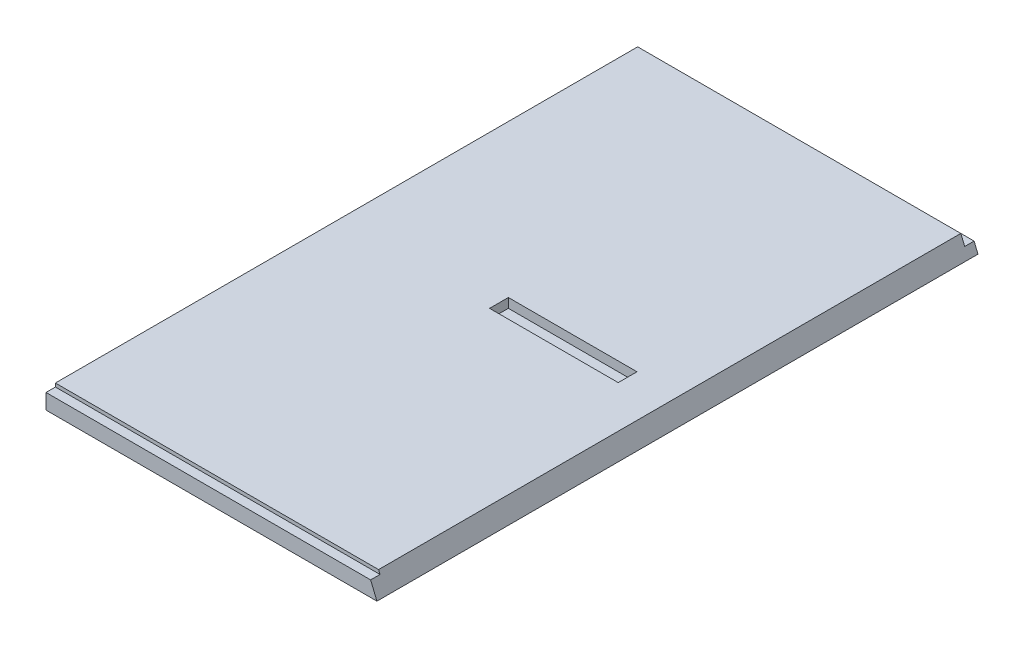
ISO-10303-21;
HEADER;
FILE_DESCRIPTION(('STEP AP214'),'2;1');
FILE_NAME('part.step','',(''),(''),'','','');
FILE_SCHEMA(('AUTOMOTIVE_DESIGN { 1 0 10303 214 1 1 1 1 }'));
ENDSEC;
DATA;
#1=APPLICATION_CONTEXT('core data for automotive mechanical design processes');
#2=APPLICATION_PROTOCOL_DEFINITION('international standard','automotive_design',2000,#1);
#3=PRODUCT_CONTEXT('',#1,'mechanical');
#4=PRODUCT('Part','Part','',(#3));
#5=PRODUCT_RELATED_PRODUCT_CATEGORY('part','',(#4));
#6=PRODUCT_DEFINITION_FORMATION('','',#4);
#7=PRODUCT_DEFINITION_CONTEXT('part definition',#1,'design');
#8=PRODUCT_DEFINITION('design','',#6,#7);
#9=PRODUCT_DEFINITION_SHAPE('','',#8);
#10=(LENGTH_UNIT() NAMED_UNIT(*) SI_UNIT(.MILLI.,.METRE.));
#11=(NAMED_UNIT(*) PLANE_ANGLE_UNIT() SI_UNIT($,.RADIAN.));
#12=(NAMED_UNIT(*) SI_UNIT($,.STERADIAN.) SOLID_ANGLE_UNIT());
#13=UNCERTAINTY_MEASURE_WITH_UNIT(LENGTH_MEASURE(1.E-05),#10,'distance_accuracy_value','');
#14=(GEOMETRIC_REPRESENTATION_CONTEXT(3) GLOBAL_UNCERTAINTY_ASSIGNED_CONTEXT((#13)) GLOBAL_UNIT_ASSIGNED_CONTEXT((#10,
#11,#12)) REPRESENTATION_CONTEXT('',''));
#15=CARTESIAN_POINT('',(0.,0.,0.));
#16=DIRECTION('',(0.,0.,1.));
#17=DIRECTION('',(1.,0.,0.));
#18=AXIS2_PLACEMENT_3D('',#15,#16,#17);
#19=CARTESIAN_POINT('',(0.,0.,0.));
#20=DIRECTION('',(0.,0.,-1.));
#21=DIRECTION('',(-1.,0.,0.));
#22=AXIS2_PLACEMENT_3D('',#19,#20,#21);
#23=PLANE('',#22);
#24=DIRECTION('',(0.,-1.,0.));
#25=VECTOR('',#24,1.);
#26=CARTESIAN_POINT('',(0.,0.,0.));
#27=LINE('',#26,#25);
#28=CARTESIAN_POINT('',(0.,6.35,0.));
#29=VERTEX_POINT('',#28);
#30=CARTESIAN_POINT('',(0.,0.,0.));
#31=VERTEX_POINT('',#30);
#32=EDGE_CURVE('E191',#29,#31,#27,.T.);
#33=ORIENTED_EDGE('',*,*,#32,.F.);
#34=DIRECTION('',(1.,0.,0.));
#35=VECTOR('',#34,1.);
#36=CARTESIAN_POINT('',(0.,6.35,0.));
#37=LINE('',#36,#35);
#38=CARTESIAN_POINT('',(221.143743878931,6.34999999999997,0.));
#39=VERTEX_POINT('',#38);
#40=EDGE_CURVE('E11',#29,#39,#37,.T.);
#41=ORIENTED_EDGE('',*,*,#40,.T.);
#42=DIRECTION('',(-0.382683432365094,0.923879532511285,0.));
#43=VECTOR('',#42,1.);
#44=CARTESIAN_POINT('',(218.513487757862,12.7,0.));
#45=LINE('',#44,#43);
#46=CARTESIAN_POINT('',(223.774,0.,0.));
#47=VERTEX_POINT('',#46);
#48=EDGE_CURVE('E199',#47,#39,#45,.T.);
#49=ORIENTED_EDGE('',*,*,#48,.F.);
#50=DIRECTION('',(1.,0.,0.));
#51=VECTOR('',#50,1.);
#52=CARTESIAN_POINT('',(223.774,0.,0.));
#53=LINE('',#52,#51);
#54=EDGE_CURVE('E186',#31,#47,#53,.T.);
#55=ORIENTED_EDGE('',*,*,#54,.F.);
#56=EDGE_LOOP('',(#33,#41,#49,#55));
#57=FACE_BOUND('',#56,.T.);
#58=ADVANCED_FACE('F33',(#57),#23,.T.);
#59=CARTESIAN_POINT('',(218.513487757862,12.7,406.4));
#60=DIRECTION('',(-0.923879532511285,-0.382683432365094,0.));
#61=DIRECTION('',(0.382683432365094,-0.923879532511285,0.));
#62=AXIS2_PLACEMENT_3D('',#59,#60,#61);
#63=PLANE('',#62);
#64=DIRECTION('',(0.,0.,-1.));
#65=VECTOR('',#64,1.);
#66=CARTESIAN_POINT('',(221.143743878931,6.34999999999997,406.4));
#67=LINE('',#66,#65);
#68=CARTESIAN_POINT('',(221.143743878931,6.34999999999997,6.35));
#69=VERTEX_POINT('',#68);
#70=EDGE_CURVE('E48',#69,#39,#67,.T.);
#71=ORIENTED_EDGE('',*,*,#70,.F.);
#72=DIRECTION('',(-0.382683432365094,0.923879532511285,0.));
#73=VECTOR('',#72,1.);
#74=CARTESIAN_POINT('',(218.513487757862,12.7,6.35000000000002));
#75=LINE('',#74,#73);
#76=CARTESIAN_POINT('',(218.513487757862,12.7,6.35));
#77=VERTEX_POINT('',#76);
#78=EDGE_CURVE('E129',#69,#77,#75,.T.);
#79=ORIENTED_EDGE('',*,*,#78,.T.);
#80=DIRECTION('',(0.,0.,-1.));
#81=VECTOR('',#80,1.);
#82=CARTESIAN_POINT('',(218.513487757862,12.7,406.4));
#83=LINE('',#82,#81);
#84=CARTESIAN_POINT('',(218.513487757862,12.7,400.05));
#85=VERTEX_POINT('',#84);
#86=EDGE_CURVE('E206',#85,#77,#83,.T.);
#87=ORIENTED_EDGE('',*,*,#86,.F.);
#88=DIRECTION('',(-0.382683432365094,0.923879532511285,0.));
#89=VECTOR('',#88,1.);
#90=CARTESIAN_POINT('',(218.513487757862,12.7,400.05));
#91=LINE('',#90,#89);
#92=CARTESIAN_POINT('',(219.491943034899,10.3378,400.05));
#93=VERTEX_POINT('',#92);
#94=EDGE_CURVE('E184',#93,#85,#91,.T.);
#95=ORIENTED_EDGE('',*,*,#94,.F.);
#96=DIRECTION('',(0.,0.,1.));
#97=VECTOR('',#96,1.);
#98=CARTESIAN_POINT('',(219.491943034899,10.3378,406.4));
#99=LINE('',#98,#97);
#100=CARTESIAN_POINT('',(219.491943034899,10.3378,406.4));
#101=VERTEX_POINT('',#100);
#102=EDGE_CURVE('E181',#93,#101,#99,.T.);
#103=ORIENTED_EDGE('',*,*,#102,.T.);
#104=DIRECTION('',(-0.382683432365094,0.923879532511285,0.));
#105=VECTOR('',#104,1.);
#106=CARTESIAN_POINT('',(218.513487757862,12.7,406.4));
#107=LINE('',#106,#105);
#108=CARTESIAN_POINT('',(223.774,0.,406.4));
#109=VERTEX_POINT('',#108);
#110=EDGE_CURVE('E190',#109,#101,#107,.T.);
#111=ORIENTED_EDGE('',*,*,#110,.F.);
#112=DIRECTION('',(0.,0.,-1.));
#113=VECTOR('',#112,1.);
#114=CARTESIAN_POINT('',(223.774,0.,406.4));
#115=LINE('',#114,#113);
#116=EDGE_CURVE('E209',#109,#47,#115,.T.);
#117=ORIENTED_EDGE('',*,*,#116,.T.);
#118=ORIENTED_EDGE('',*,*,#48,.T.);
#119=EDGE_LOOP('',(#71,#79,#87,#95,#103,#111,#117,#118));
#120=FACE_BOUND('',#119,.T.);
#121=ADVANCED_FACE('F248',(#120),#63,.F.);
#122=CARTESIAN_POINT('',(0.,12.7,406.4));
#123=DIRECTION('',(0.,-1.,0.));
#124=DIRECTION('',(1.,0.,0.));
#125=AXIS2_PLACEMENT_3D('',#122,#123,#124);
#126=PLANE('',#125);
#127=DIRECTION('',(0.,0.,-1.));
#128=VECTOR('',#127,1.);
#129=CARTESIAN_POINT('',(190.05165273428,12.7000000000459,209.55));
#130=LINE('',#129,#128);
#131=CARTESIAN_POINT('',(190.05165273428,12.7000000000459,209.55));
#132=VERTEX_POINT('',#131);
#133=CARTESIAN_POINT('',(190.05165273428,12.7,196.85));
#134=VERTEX_POINT('',#133);
#135=EDGE_CURVE('E55',#132,#134,#130,.T.);
#136=ORIENTED_EDGE('',*,*,#135,.F.);
#137=DIRECTION('',(-1.,0.,0.));
#138=VECTOR('',#137,1.);
#139=CARTESIAN_POINT('',(0.,12.7,209.55));
#140=LINE('',#139,#138);
#141=CARTESIAN_POINT('',(103.075451784147,12.7000000000459,209.55));
#142=VERTEX_POINT('',#141);
#143=EDGE_CURVE('E41',#132,#142,#140,.T.);
#144=ORIENTED_EDGE('',*,*,#143,.T.);
#145=DIRECTION('',(0.,0.,-1.));
#146=VECTOR('',#145,1.);
#147=CARTESIAN_POINT('',(103.075451784147,12.7000000000459,209.55));
#148=LINE('',#147,#146);
#149=CARTESIAN_POINT('',(103.075451784147,12.7000000000459,196.85));
#150=VERTEX_POINT('',#149);
#151=EDGE_CURVE('E167',#142,#150,#148,.T.);
#152=ORIENTED_EDGE('',*,*,#151,.T.);
#153=DIRECTION('',(-1.,0.,0.));
#154=VECTOR('',#153,1.);
#155=CARTESIAN_POINT('',(0.,12.7,196.85));
#156=LINE('',#155,#154);
#157=EDGE_CURVE('E215',#134,#150,#156,.T.);
#158=ORIENTED_EDGE('',*,*,#157,.F.);
#159=EDGE_LOOP('',(#136,#144,#152,#158));
#160=FACE_BOUND('',#159,.T.);
#161=ORIENTED_EDGE('',*,*,#86,.T.);
#162=DIRECTION('',(1.,0.,0.));
#163=VECTOR('',#162,1.);
#164=CARTESIAN_POINT('',(0.,12.7,6.35));
#165=LINE('',#164,#163);
#166=CARTESIAN_POINT('',(0.,12.7,6.35));
#167=VERTEX_POINT('',#166);
#168=EDGE_CURVE('E136',#167,#77,#165,.T.);
#169=ORIENTED_EDGE('',*,*,#168,.F.);
#170=DIRECTION('',(0.,0.,-1.));
#171=VECTOR('',#170,1.);
#172=CARTESIAN_POINT('',(0.,12.7,406.4));
#173=LINE('',#172,#171);
#174=CARTESIAN_POINT('',(0.,12.7,400.05));
#175=VERTEX_POINT('',#174);
#176=EDGE_CURVE('E142',#175,#167,#173,.T.);
#177=ORIENTED_EDGE('',*,*,#176,.F.);
#178=DIRECTION('',(1.,0.,0.));
#179=VECTOR('',#178,1.);
#180=CARTESIAN_POINT('',(0.,12.7,400.05));
#181=LINE('',#180,#179);
#182=EDGE_CURVE('E170',#175,#85,#181,.T.);
#183=ORIENTED_EDGE('',*,*,#182,.T.);
#184=EDGE_LOOP('',(#161,#169,#177,#183));
#185=FACE_BOUND('',#184,.T.);
#186=ADVANCED_FACE('F218',(#160,#185),#126,.F.);
#187=CARTESIAN_POINT('',(0.,0.,406.4));
#188=DIRECTION('',(1.,0.,0.));
#189=DIRECTION('',(0.,0.,-1.));
#190=AXIS2_PLACEMENT_3D('',#187,#188,#189);
#191=PLANE('',#190);
#192=ORIENTED_EDGE('',*,*,#176,.T.);
#193=DIRECTION('',(0.,1.,0.));
#194=VECTOR('',#193,1.);
#195=CARTESIAN_POINT('',(0.,6.35,6.35));
#196=LINE('',#195,#194);
#197=CARTESIAN_POINT('',(0.,6.35,6.35));
#198=VERTEX_POINT('',#197);
#199=EDGE_CURVE('E126',#198,#167,#196,.T.);
#200=ORIENTED_EDGE('',*,*,#199,.F.);
#201=DIRECTION('',(0.,0.,1.));
#202=VECTOR('',#201,1.);
#203=CARTESIAN_POINT('',(0.,6.35,0.));
#204=LINE('',#203,#202);
#205=EDGE_CURVE('E130',#29,#198,#204,.T.);
#206=ORIENTED_EDGE('',*,*,#205,.F.);
#207=ORIENTED_EDGE('',*,*,#32,.T.);
#208=DIRECTION('',(0.,0.,-1.));
#209=VECTOR('',#208,1.);
#210=CARTESIAN_POINT('',(0.,0.,406.4));
#211=LINE('',#210,#209);
#212=CARTESIAN_POINT('',(0.,0.,406.4));
#213=VERTEX_POINT('',#212);
#214=EDGE_CURVE('E196',#213,#31,#211,.T.);
#215=ORIENTED_EDGE('',*,*,#214,.F.);
#216=DIRECTION('',(0.,-1.,0.));
#217=VECTOR('',#216,1.);
#218=CARTESIAN_POINT('',(0.,0.,406.4));
#219=LINE('',#218,#217);
#220=CARTESIAN_POINT('',(0.,10.3378,406.4));
#221=VERTEX_POINT('',#220);
#222=EDGE_CURVE('E194',#221,#213,#219,.T.);
#223=ORIENTED_EDGE('',*,*,#222,.F.);
#224=DIRECTION('',(0.,0.,-1.));
#225=VECTOR('',#224,1.);
#226=CARTESIAN_POINT('',(0.,10.3378,406.4));
#227=LINE('',#226,#225);
#228=CARTESIAN_POINT('',(0.,10.3378,400.05));
#229=VERTEX_POINT('',#228);
#230=EDGE_CURVE('E171',#221,#229,#227,.T.);
#231=ORIENTED_EDGE('',*,*,#230,.T.);
#232=DIRECTION('',(0.,1.,0.));
#233=VECTOR('',#232,1.);
#234=CARTESIAN_POINT('',(0.,10.3378,400.05));
#235=LINE('',#234,#233);
#236=EDGE_CURVE('E177',#229,#175,#235,.T.);
#237=ORIENTED_EDGE('',*,*,#236,.T.);
#238=EDGE_LOOP('',(#192,#200,#206,#207,#215,#223,#231,#237));
#239=FACE_BOUND('',#238,.T.);
#240=ADVANCED_FACE('F139',(#239),#191,.F.);
#241=CARTESIAN_POINT('',(223.774,0.,406.4));
#242=DIRECTION('',(0.,1.,0.));
#243=DIRECTION('',(-1.,0.,0.));
#244=AXIS2_PLACEMENT_3D('',#241,#242,#243);
#245=PLANE('',#244);
#246=ORIENTED_EDGE('',*,*,#54,.T.);
#247=ORIENTED_EDGE('',*,*,#116,.F.);
#248=DIRECTION('',(1.,0.,0.));
#249=VECTOR('',#248,1.);
#250=CARTESIAN_POINT('',(223.774,0.,406.4));
#251=LINE('',#250,#249);
#252=EDGE_CURVE('E187',#213,#109,#251,.T.);
#253=ORIENTED_EDGE('',*,*,#252,.F.);
#254=ORIENTED_EDGE('',*,*,#214,.T.);
#255=EDGE_LOOP('',(#246,#247,#253,#254));
#256=FACE_BOUND('',#255,.T.);
#257=ADVANCED_FACE('F35',(#256),#245,.F.);
#258=CARTESIAN_POINT('',(0.,0.,406.4));
#259=DIRECTION('',(0.,0.,-1.));
#260=DIRECTION('',(-1.,0.,0.));
#261=AXIS2_PLACEMENT_3D('',#258,#259,#260);
#262=PLANE('',#261);
#263=ORIENTED_EDGE('',*,*,#110,.T.);
#264=DIRECTION('',(-1.,0.,0.));
#265=VECTOR('',#264,1.);
#266=CARTESIAN_POINT('',(0.,10.3378,406.4));
#267=LINE('',#266,#265);
#268=EDGE_CURVE('E212',#101,#221,#267,.T.);
#269=ORIENTED_EDGE('',*,*,#268,.T.);
#270=ORIENTED_EDGE('',*,*,#222,.T.);
#271=ORIENTED_EDGE('',*,*,#252,.T.);
#272=EDGE_LOOP('',(#263,#269,#270,#271));
#273=FACE_BOUND('',#272,.T.);
#274=ADVANCED_FACE('F257',(#273),#262,.F.);
#275=CARTESIAN_POINT('',(0.,10.3378,400.05));
#276=DIRECTION('',(0.,0.,1.));
#277=DIRECTION('',(1.,0.,0.));
#278=AXIS2_PLACEMENT_3D('',#275,#276,#277);
#279=PLANE('',#278);
#280=ORIENTED_EDGE('',*,*,#94,.T.);
#281=ORIENTED_EDGE('',*,*,#182,.F.);
#282=ORIENTED_EDGE('',*,*,#236,.F.);
#283=DIRECTION('',(1.,0.,0.));
#284=VECTOR('',#283,1.);
#285=CARTESIAN_POINT('',(0.,10.3378,400.05));
#286=LINE('',#285,#284);
#287=EDGE_CURVE('E174',#229,#93,#286,.T.);
#288=ORIENTED_EDGE('',*,*,#287,.T.);
#289=EDGE_LOOP('',(#280,#281,#282,#288));
#290=FACE_BOUND('',#289,.T.);
#291=ADVANCED_FACE('F283',(#290),#279,.T.);
#292=CARTESIAN_POINT('',(0.,10.3378,0.));
#293=DIRECTION('',(0.,-1.,0.));
#294=DIRECTION('',(1.,0.,0.));
#295=AXIS2_PLACEMENT_3D('',#292,#293,#294);
#296=PLANE('',#295);
#297=ORIENTED_EDGE('',*,*,#287,.F.);
#298=ORIENTED_EDGE('',*,*,#230,.F.);
#299=ORIENTED_EDGE('',*,*,#268,.F.);
#300=ORIENTED_EDGE('',*,*,#102,.F.);
#301=EDGE_LOOP('',(#297,#298,#299,#300));
#302=FACE_BOUND('',#301,.T.);
#303=ADVANCED_FACE('F244',(#302),#296,.F.);
#304=CARTESIAN_POINT('',(1110.76730517319,-412.015446324385,209.55));
#305=DIRECTION('',(0.,0.,1.));
#306=DIRECTION('',(0.,1.,0.));
#307=AXIS2_PLACEMENT_3D('',#304,#305,#306);
#308=PLANE('',#307);
#309=DIRECTION('',(0.,1.,0.));
#310=VECTOR('',#309,1.);
#311=CARTESIAN_POINT('',(190.05165273428,12.7000000000459,209.55));
#312=LINE('',#311,#310);
#313=CARTESIAN_POINT('',(190.05165273428,6.35000000004587,209.55));
#314=VERTEX_POINT('',#313);
#315=EDGE_CURVE('E154',#314,#132,#312,.T.);
#316=ORIENTED_EDGE('',*,*,#315,.F.);
#317=DIRECTION('',(1.,0.,0.));
#318=VECTOR('',#317,1.);
#319=CARTESIAN_POINT('',(190.05165273428,6.35000000004587,209.55));
#320=LINE('',#319,#318);
#321=CARTESIAN_POINT('',(103.075451784147,6.35000000004587,209.55));
#322=VERTEX_POINT('',#321);
#323=EDGE_CURVE('E151',#322,#314,#320,.T.);
#324=ORIENTED_EDGE('',*,*,#323,.F.);
#325=DIRECTION('',(0.,-1.,0.));
#326=VECTOR('',#325,1.);
#327=CARTESIAN_POINT('',(103.075451784147,6.35000000004587,209.55));
#328=LINE('',#327,#326);
#329=EDGE_CURVE('E149',#142,#322,#328,.T.);
#330=ORIENTED_EDGE('',*,*,#329,.F.);
#331=ORIENTED_EDGE('',*,*,#143,.F.);
#332=EDGE_LOOP('',(#316,#324,#330,#331));
#333=FACE_BOUND('',#332,.T.);
#334=ADVANCED_FACE('F224',(#333),#308,.F.);
#335=CARTESIAN_POINT('',(1110.76730517319,-412.015446324385,196.85));
#336=DIRECTION('',(0.,0.,1.));
#337=DIRECTION('',(0.,1.,0.));
#338=AXIS2_PLACEMENT_3D('',#335,#336,#337);
#339=PLANE('',#338);
#340=ORIENTED_EDGE('',*,*,#157,.T.);
#341=DIRECTION('',(0.,-1.,0.));
#342=VECTOR('',#341,1.);
#343=CARTESIAN_POINT('',(103.075451784147,6.35000000004587,196.85));
#344=LINE('',#343,#342);
#345=CARTESIAN_POINT('',(103.075451784147,6.35000000004587,196.85));
#346=VERTEX_POINT('',#345);
#347=EDGE_CURVE('E148',#150,#346,#344,.T.);
#348=ORIENTED_EDGE('',*,*,#347,.T.);
#349=DIRECTION('',(1.,0.,0.));
#350=VECTOR('',#349,1.);
#351=CARTESIAN_POINT('',(190.05165273428,6.35000000004587,196.85));
#352=LINE('',#351,#350);
#353=CARTESIAN_POINT('',(190.05165273428,6.35000000004587,196.85));
#354=VERTEX_POINT('',#353);
#355=EDGE_CURVE('E157',#346,#354,#352,.T.);
#356=ORIENTED_EDGE('',*,*,#355,.T.);
#357=DIRECTION('',(0.,1.,0.));
#358=VECTOR('',#357,1.);
#359=CARTESIAN_POINT('',(190.05165273428,12.7000000000459,196.85));
#360=LINE('',#359,#358);
#361=EDGE_CURVE('E152',#354,#134,#360,.T.);
#362=ORIENTED_EDGE('',*,*,#361,.T.);
#363=EDGE_LOOP('',(#340,#348,#356,#362));
#364=FACE_BOUND('',#363,.T.);
#365=ADVANCED_FACE('F236',(#364),#339,.T.);
#366=CARTESIAN_POINT('',(103.075451784147,6.35000000004587,209.55));
#367=DIRECTION('',(1.,0.,0.));
#368=DIRECTION('',(0.,0.,-1.));
#369=AXIS2_PLACEMENT_3D('',#366,#367,#368);
#370=PLANE('',#369);
#371=ORIENTED_EDGE('',*,*,#347,.F.);
#372=ORIENTED_EDGE('',*,*,#151,.F.);
#373=ORIENTED_EDGE('',*,*,#329,.T.);
#374=DIRECTION('',(0.,0.,-1.));
#375=VECTOR('',#374,1.);
#376=CARTESIAN_POINT('',(103.075451784147,6.35000000004587,209.55));
#377=LINE('',#376,#375);
#378=EDGE_CURVE('E164',#322,#346,#377,.T.);
#379=ORIENTED_EDGE('',*,*,#378,.T.);
#380=EDGE_LOOP('',(#371,#372,#373,#379));
#381=FACE_BOUND('',#380,.T.);
#382=ADVANCED_FACE('F234',(#381),#370,.T.);
#383=CARTESIAN_POINT('',(190.05165273428,6.35000000004587,209.55));
#384=DIRECTION('',(0.,1.,0.));
#385=DIRECTION('',(0.,0.,-1.));
#386=AXIS2_PLACEMENT_3D('',#383,#384,#385);
#387=PLANE('',#386);
#388=ORIENTED_EDGE('',*,*,#355,.F.);
#389=ORIENTED_EDGE('',*,*,#378,.F.);
#390=ORIENTED_EDGE('',*,*,#323,.T.);
#391=DIRECTION('',(0.,0.,-1.));
#392=VECTOR('',#391,1.);
#393=CARTESIAN_POINT('',(190.05165273428,6.35000000004587,209.55));
#394=LINE('',#393,#392);
#395=EDGE_CURVE('E161',#314,#354,#394,.T.);
#396=ORIENTED_EDGE('',*,*,#395,.T.);
#397=EDGE_LOOP('',(#388,#389,#390,#396));
#398=FACE_BOUND('',#397,.T.);
#399=ADVANCED_FACE('F230',(#398),#387,.T.);
#400=CARTESIAN_POINT('',(190.05165273428,12.7000000000459,209.55));
#401=DIRECTION('',(-1.,0.,0.));
#402=DIRECTION('',(0.,0.,1.));
#403=AXIS2_PLACEMENT_3D('',#400,#401,#402);
#404=PLANE('',#403);
#405=ORIENTED_EDGE('',*,*,#361,.F.);
#406=ORIENTED_EDGE('',*,*,#395,.F.);
#407=ORIENTED_EDGE('',*,*,#315,.T.);
#408=ORIENTED_EDGE('',*,*,#135,.T.);
#409=EDGE_LOOP('',(#405,#406,#407,#408));
#410=FACE_BOUND('',#409,.T.);
#411=ADVANCED_FACE('F227',(#410),#404,.T.);
#412=CARTESIAN_POINT('',(0.,6.35,6.35));
#413=DIRECTION('',(0.,0.,1.));
#414=DIRECTION('',(1.,0.,0.));
#415=AXIS2_PLACEMENT_3D('',#412,#413,#414);
#416=PLANE('',#415);
#417=DIRECTION('',(1.,0.,0.));
#418=VECTOR('',#417,1.);
#419=CARTESIAN_POINT('',(0.,6.35,6.35));
#420=LINE('',#419,#418);
#421=EDGE_CURVE('E122',#198,#69,#420,.T.);
#422=ORIENTED_EDGE('',*,*,#421,.F.);
#423=ORIENTED_EDGE('',*,*,#199,.T.);
#424=ORIENTED_EDGE('',*,*,#168,.T.);
#425=ORIENTED_EDGE('',*,*,#78,.F.);
#426=EDGE_LOOP('',(#422,#423,#424,#425));
#427=FACE_BOUND('',#426,.T.);
#428=ADVANCED_FACE('F124',(#427),#416,.F.);
#429=CARTESIAN_POINT('',(0.,6.35,0.));
#430=DIRECTION('',(0.,1.,0.));
#431=DIRECTION('',(-1.,0.,0.));
#432=AXIS2_PLACEMENT_3D('',#429,#430,#431);
#433=PLANE('',#432);
#434=ORIENTED_EDGE('',*,*,#70,.T.);
#435=ORIENTED_EDGE('',*,*,#40,.F.);
#436=ORIENTED_EDGE('',*,*,#205,.T.);
#437=ORIENTED_EDGE('',*,*,#421,.T.);
#438=EDGE_LOOP('',(#434,#435,#436,#437));
#439=FACE_BOUND('',#438,.T.);
#440=ADVANCED_FACE('F133',(#439),#433,.T.);
#441=CLOSED_SHELL('',(#58,#121,#186,#240,#257,#274,#291,#303,#334,#365,#382,#399,#411,#428,#440));
#442=MANIFOLD_SOLID_BREP('B2',#441);
#443=ADVANCED_BREP_SHAPE_REPRESENTATION('',(#18,#442),#14);
#444=SHAPE_DEFINITION_REPRESENTATION(#9,#443);
ENDSEC;
END-ISO-10303-21;
